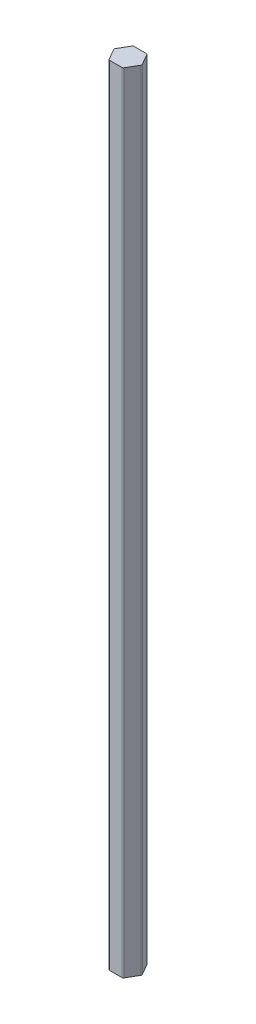
ISO-10303-21;
HEADER;
FILE_DESCRIPTION(('STEP AP214'),'2;1');
FILE_NAME('part.step','',(''),(''),'','','');
FILE_SCHEMA(('AUTOMOTIVE_DESIGN { 1 0 10303 214 1 1 1 1 }'));
ENDSEC;
DATA;
#1=APPLICATION_CONTEXT('core data for automotive mechanical design processes');
#2=APPLICATION_PROTOCOL_DEFINITION('international standard','automotive_design',2000,#1);
#3=PRODUCT_CONTEXT('',#1,'mechanical');
#4=PRODUCT('Part','Part','',(#3));
#5=PRODUCT_RELATED_PRODUCT_CATEGORY('part','',(#4));
#6=PRODUCT_DEFINITION_FORMATION('','',#4);
#7=PRODUCT_DEFINITION_CONTEXT('part definition',#1,'design');
#8=PRODUCT_DEFINITION('design','',#6,#7);
#9=PRODUCT_DEFINITION_SHAPE('','',#8);
#10=(LENGTH_UNIT() NAMED_UNIT(*) SI_UNIT(.MILLI.,.METRE.));
#11=(NAMED_UNIT(*) PLANE_ANGLE_UNIT() SI_UNIT($,.RADIAN.));
#12=(NAMED_UNIT(*) SI_UNIT($,.STERADIAN.) SOLID_ANGLE_UNIT());
#13=UNCERTAINTY_MEASURE_WITH_UNIT(LENGTH_MEASURE(1.E-05),#10,'distance_accuracy_value','');
#14=(GEOMETRIC_REPRESENTATION_CONTEXT(3) GLOBAL_UNCERTAINTY_ASSIGNED_CONTEXT((#13)) GLOBAL_UNIT_ASSIGNED_CONTEXT((#10,
#11,#12)) REPRESENTATION_CONTEXT('',''));
#15=CARTESIAN_POINT('',(0.,0.,0.));
#16=DIRECTION('',(0.,0.,1.));
#17=DIRECTION('',(1.,0.,0.));
#18=AXIS2_PLACEMENT_3D('',#15,#16,#17);
#19=CARTESIAN_POINT('',(-38.1051177665153,2860.,22.));
#20=DIRECTION('',(0.866025403784438,0.,-0.500000000000001));
#21=DIRECTION('',(-0.500000000000001,0.,-0.866025403784438));
#22=AXIS2_PLACEMENT_3D('',#19,#20,#21);
#23=PLANE('',#22);
#24=DIRECTION('',(0.5,0.,0.866025403784438));
#25=VECTOR('',#24,1.);
#26=CARTESIAN_POINT('',(-38.1051177665153,0.,22.));
#27=LINE('',#26,#25);
#28=CARTESIAN_POINT('',(-49.363448015713,0.,2.50000000000004));
#29=VERTEX_POINT('',#28);
#30=CARTESIAN_POINT('',(-26.8467875173176,0.,41.5));
#31=VERTEX_POINT('',#30);
#32=EDGE_CURVE('E160',#29,#31,#27,.T.);
#33=ORIENTED_EDGE('',*,*,#32,.T.);
#34=DIRECTION('',(0.,-1.,0.));
#35=VECTOR('',#34,1.);
#36=CARTESIAN_POINT('',(-26.8467875173176,2860.,41.5));
#37=LINE('',#36,#35);
#38=CARTESIAN_POINT('',(-26.8467875173176,2860.,41.5));
#39=VERTEX_POINT('',#38);
#40=EDGE_CURVE('E11',#39,#31,#37,.T.);
#41=ORIENTED_EDGE('',*,*,#40,.F.);
#42=DIRECTION('',(0.5,0.,0.866025403784438));
#43=VECTOR('',#42,1.);
#44=CARTESIAN_POINT('',(-38.1051177665153,2860.,22.));
#45=LINE('',#44,#43);
#46=CARTESIAN_POINT('',(-49.363448015713,2860.,2.50000000000004));
#47=VERTEX_POINT('',#46);
#48=EDGE_CURVE('E184',#47,#39,#45,.T.);
#49=ORIENTED_EDGE('',*,*,#48,.F.);
#50=DIRECTION('',(0.,-1.,0.));
#51=VECTOR('',#50,1.);
#52=CARTESIAN_POINT('',(-49.363448015713,2860.,2.50000000000004));
#53=LINE('',#52,#51);
#54=EDGE_CURVE('E156',#47,#29,#53,.T.);
#55=ORIENTED_EDGE('',*,*,#54,.T.);
#56=EDGE_LOOP('',(#33,#41,#49,#55));
#57=FACE_BOUND('',#56,.T.);
#58=ADVANCED_FACE('F39',(#57),#23,.F.);
#59=CARTESIAN_POINT('',(-22.5166604983954,2860.,39.));
#60=DIRECTION('',(0.,-1.,0.));
#61=DIRECTION('',(0.,0.,-1.));
#62=AXIS2_PLACEMENT_3D('',#59,#60,#61);
#63=CYLINDRICAL_SURFACE('',#62,5.);
#64=CARTESIAN_POINT('',(-22.5166604983954,0.,39.));
#65=DIRECTION('',(0.,1.,0.));
#66=DIRECTION('',(0.,0.,1.));
#67=AXIS2_PLACEMENT_3D('',#64,#65,#66);
#68=CIRCLE('',#67,5.);
#69=CARTESIAN_POINT('',(-22.5166604983953,0.,44.));
#70=VERTEX_POINT('',#69);
#71=EDGE_CURVE('E163',#31,#70,#68,.T.);
#72=ORIENTED_EDGE('',*,*,#71,.T.);
#73=DIRECTION('',(0.,-1.,0.));
#74=VECTOR('',#73,1.);
#75=CARTESIAN_POINT('',(-22.5166604983953,2860.,44.));
#76=LINE('',#75,#74);
#77=CARTESIAN_POINT('',(-22.5166604983953,2860.,44.));
#78=VERTEX_POINT('',#77);
#79=EDGE_CURVE('E47',#78,#70,#76,.T.);
#80=ORIENTED_EDGE('',*,*,#79,.F.);
#81=CARTESIAN_POINT('',(-22.5166604983954,2860.,39.));
#82=DIRECTION('',(0.,1.,0.));
#83=DIRECTION('',(0.,0.,1.));
#84=AXIS2_PLACEMENT_3D('',#81,#82,#83);
#85=CIRCLE('',#84,5.);
#86=EDGE_CURVE('E110',#39,#78,#85,.T.);
#87=ORIENTED_EDGE('',*,*,#86,.F.);
#88=ORIENTED_EDGE('',*,*,#40,.T.);
#89=EDGE_LOOP('',(#72,#80,#87,#88));
#90=FACE_BOUND('',#89,.T.);
#91=ADVANCED_FACE('F258',(#90),#63,.T.);
#92=CARTESIAN_POINT('',(0.,2860.,44.));
#93=DIRECTION('',(0.,0.,-1.));
#94=DIRECTION('',(-1.,0.,0.));
#95=AXIS2_PLACEMENT_3D('',#92,#93,#94);
#96=PLANE('',#95);
#97=DIRECTION('',(1.,0.,0.));
#98=VECTOR('',#97,1.);
#99=CARTESIAN_POINT('',(0.,0.,44.));
#100=LINE('',#99,#98);
#101=CARTESIAN_POINT('',(22.5166604983954,0.,44.));
#102=VERTEX_POINT('',#101);
#103=EDGE_CURVE('E165',#70,#102,#100,.T.);
#104=ORIENTED_EDGE('',*,*,#103,.T.);
#105=DIRECTION('',(0.,-1.,0.));
#106=VECTOR('',#105,1.);
#107=CARTESIAN_POINT('',(22.5166604983954,2860.,44.));
#108=LINE('',#107,#106);
#109=CARTESIAN_POINT('',(22.5166604983954,2860.,44.));
#110=VERTEX_POINT('',#109);
#111=EDGE_CURVE('E201',#110,#102,#108,.T.);
#112=ORIENTED_EDGE('',*,*,#111,.F.);
#113=DIRECTION('',(1.,0.,0.));
#114=VECTOR('',#113,1.);
#115=CARTESIAN_POINT('',(0.,2860.,44.));
#116=LINE('',#115,#114);
#117=EDGE_CURVE('E209',#78,#110,#116,.T.);
#118=ORIENTED_EDGE('',*,*,#117,.F.);
#119=ORIENTED_EDGE('',*,*,#79,.T.);
#120=EDGE_LOOP('',(#104,#112,#118,#119));
#121=FACE_BOUND('',#120,.T.);
#122=ADVANCED_FACE('F207',(#121),#96,.F.);
#123=CARTESIAN_POINT('',(22.5166604983954,2860.,39.));
#124=DIRECTION('',(0.,-1.,0.));
#125=DIRECTION('',(0.,0.,-1.));
#126=AXIS2_PLACEMENT_3D('',#123,#124,#125);
#127=CYLINDRICAL_SURFACE('',#126,5.);
#128=CARTESIAN_POINT('',(22.5166604983954,0.,39.));
#129=DIRECTION('',(0.,1.,0.));
#130=DIRECTION('',(0.,0.,1.));
#131=AXIS2_PLACEMENT_3D('',#128,#129,#130);
#132=CIRCLE('',#131,5.);
#133=CARTESIAN_POINT('',(26.8467875173176,0.,41.5));
#134=VERTEX_POINT('',#133);
#135=EDGE_CURVE('E167',#102,#134,#132,.T.);
#136=ORIENTED_EDGE('',*,*,#135,.T.);
#137=DIRECTION('',(0.,-1.,0.));
#138=VECTOR('',#137,1.);
#139=CARTESIAN_POINT('',(26.8467875173176,2860.,41.5));
#140=LINE('',#139,#138);
#141=CARTESIAN_POINT('',(26.8467875173176,2860.,41.5));
#142=VERTEX_POINT('',#141);
#143=EDGE_CURVE('E198',#142,#134,#140,.T.);
#144=ORIENTED_EDGE('',*,*,#143,.F.);
#145=CARTESIAN_POINT('',(22.5166604983954,2860.,39.));
#146=DIRECTION('',(0.,1.,0.));
#147=DIRECTION('',(0.,0.,1.));
#148=AXIS2_PLACEMENT_3D('',#145,#146,#147);
#149=CIRCLE('',#148,5.);
#150=EDGE_CURVE('E227',#110,#142,#149,.T.);
#151=ORIENTED_EDGE('',*,*,#150,.F.);
#152=ORIENTED_EDGE('',*,*,#111,.T.);
#153=EDGE_LOOP('',(#136,#144,#151,#152));
#154=FACE_BOUND('',#153,.T.);
#155=ADVANCED_FACE('F218',(#154),#127,.T.);
#156=CARTESIAN_POINT('',(38.1051177665153,2860.,22.));
#157=DIRECTION('',(-0.866025403784439,0.,-0.5));
#158=DIRECTION('',(-0.5,0.,0.866025403784439));
#159=AXIS2_PLACEMENT_3D('',#156,#157,#158);
#160=PLANE('',#159);
#161=DIRECTION('',(0.5,0.,-0.866025403784439));
#162=VECTOR('',#161,1.);
#163=CARTESIAN_POINT('',(38.1051177665153,0.,22.));
#164=LINE('',#163,#162);
#165=CARTESIAN_POINT('',(49.363448015713,0.,2.5));
#166=VERTEX_POINT('',#165);
#167=EDGE_CURVE('E169',#134,#166,#164,.T.);
#168=ORIENTED_EDGE('',*,*,#167,.T.);
#169=DIRECTION('',(0.,-1.,0.));
#170=VECTOR('',#169,1.);
#171=CARTESIAN_POINT('',(49.363448015713,2860.,2.5));
#172=LINE('',#171,#170);
#173=CARTESIAN_POINT('',(49.363448015713,2860.,2.5));
#174=VERTEX_POINT('',#173);
#175=EDGE_CURVE('E195',#174,#166,#172,.T.);
#176=ORIENTED_EDGE('',*,*,#175,.F.);
#177=DIRECTION('',(0.5,0.,-0.866025403784439));
#178=VECTOR('',#177,1.);
#179=CARTESIAN_POINT('',(38.1051177665153,2860.,22.));
#180=LINE('',#179,#178);
#181=EDGE_CURVE('E224',#142,#174,#180,.T.);
#182=ORIENTED_EDGE('',*,*,#181,.F.);
#183=ORIENTED_EDGE('',*,*,#143,.T.);
#184=EDGE_LOOP('',(#168,#176,#182,#183));
#185=FACE_BOUND('',#184,.T.);
#186=ADVANCED_FACE('F222',(#185),#160,.F.);
#187=CARTESIAN_POINT('',(45.0333209967908,2860.,0.));
#188=DIRECTION('',(0.,-1.,0.));
#189=DIRECTION('',(0.,0.,-1.));
#190=AXIS2_PLACEMENT_3D('',#187,#188,#189);
#191=CYLINDRICAL_SURFACE('',#190,5.);
#192=CARTESIAN_POINT('',(45.0333209967908,0.,0.));
#193=DIRECTION('',(0.,1.,0.));
#194=DIRECTION('',(0.,0.,1.));
#195=AXIS2_PLACEMENT_3D('',#192,#193,#194);
#196=CIRCLE('',#195,5.);
#197=CARTESIAN_POINT('',(49.363448015713,0.,-2.50000000000005));
#198=VERTEX_POINT('',#197);
#199=EDGE_CURVE('E171',#166,#198,#196,.T.);
#200=ORIENTED_EDGE('',*,*,#199,.T.);
#201=DIRECTION('',(0.,-1.,0.));
#202=VECTOR('',#201,1.);
#203=CARTESIAN_POINT('',(49.363448015713,2860.,-2.50000000000005));
#204=LINE('',#203,#202);
#205=CARTESIAN_POINT('',(49.363448015713,2860.,-2.50000000000005));
#206=VERTEX_POINT('',#205);
#207=EDGE_CURVE('E192',#206,#198,#204,.T.);
#208=ORIENTED_EDGE('',*,*,#207,.F.);
#209=CARTESIAN_POINT('',(45.0333209967908,2860.,0.));
#210=DIRECTION('',(0.,1.,0.));
#211=DIRECTION('',(0.,0.,1.));
#212=AXIS2_PLACEMENT_3D('',#209,#210,#211);
#213=CIRCLE('',#212,5.);
#214=EDGE_CURVE('E226',#174,#206,#213,.T.);
#215=ORIENTED_EDGE('',*,*,#214,.F.);
#216=ORIENTED_EDGE('',*,*,#175,.T.);
#217=EDGE_LOOP('',(#200,#208,#215,#216));
#218=FACE_BOUND('',#217,.T.);
#219=ADVANCED_FACE('F317',(#218),#191,.T.);
#220=CARTESIAN_POINT('',(38.1051177665153,2860.,-22.));
#221=DIRECTION('',(-0.866025403784438,0.,0.500000000000001));
#222=DIRECTION('',(0.500000000000001,0.,0.866025403784438));
#223=AXIS2_PLACEMENT_3D('',#220,#221,#222);
#224=PLANE('',#223);
#225=DIRECTION('',(-0.5,0.,-0.866025403784438));
#226=VECTOR('',#225,1.);
#227=CARTESIAN_POINT('',(38.1051177665153,0.,-22.));
#228=LINE('',#227,#226);
#229=CARTESIAN_POINT('',(26.8467875173176,0.,-41.5));
#230=VERTEX_POINT('',#229);
#231=EDGE_CURVE('E173',#198,#230,#228,.T.);
#232=ORIENTED_EDGE('',*,*,#231,.T.);
#233=DIRECTION('',(0.,-1.,0.));
#234=VECTOR('',#233,1.);
#235=CARTESIAN_POINT('',(26.8467875173176,2860.,-41.5));
#236=LINE('',#235,#234);
#237=CARTESIAN_POINT('',(26.8467875173176,2860.,-41.5));
#238=VERTEX_POINT('',#237);
#239=EDGE_CURVE('E190',#238,#230,#236,.T.);
#240=ORIENTED_EDGE('',*,*,#239,.F.);
#241=DIRECTION('',(-0.5,0.,-0.866025403784438));
#242=VECTOR('',#241,1.);
#243=CARTESIAN_POINT('',(38.1051177665153,2860.,-22.));
#244=LINE('',#243,#242);
#245=EDGE_CURVE('E229',#206,#238,#244,.T.);
#246=ORIENTED_EDGE('',*,*,#245,.F.);
#247=ORIENTED_EDGE('',*,*,#207,.T.);
#248=EDGE_LOOP('',(#232,#240,#246,#247));
#249=FACE_BOUND('',#248,.T.);
#250=ADVANCED_FACE('F244',(#249),#224,.F.);
#251=CARTESIAN_POINT('',(22.5166604983954,2860.,-39.));
#252=DIRECTION('',(0.,-1.,0.));
#253=DIRECTION('',(0.,0.,-1.));
#254=AXIS2_PLACEMENT_3D('',#251,#252,#253);
#255=CYLINDRICAL_SURFACE('',#254,5.);
#256=CARTESIAN_POINT('',(22.5166604983954,0.,-39.));
#257=DIRECTION('',(0.,1.,0.));
#258=DIRECTION('',(0.,0.,1.));
#259=AXIS2_PLACEMENT_3D('',#256,#257,#258);
#260=CIRCLE('',#259,5.);
#261=CARTESIAN_POINT('',(22.5166604983954,0.,-44.));
#262=VERTEX_POINT('',#261);
#263=EDGE_CURVE('E176',#262,#230,#260,.F.);
#264=ORIENTED_EDGE('',*,*,#263,.F.);
#265=DIRECTION('',(0.,-1.,0.));
#266=VECTOR('',#265,1.);
#267=CARTESIAN_POINT('',(22.5166604983954,2860.,-44.));
#268=LINE('',#267,#266);
#269=CARTESIAN_POINT('',(22.5166604983954,2860.,-44.));
#270=VERTEX_POINT('',#269);
#271=EDGE_CURVE('E188',#270,#262,#268,.T.);
#272=ORIENTED_EDGE('',*,*,#271,.F.);
#273=CARTESIAN_POINT('',(22.5166604983954,2860.,-39.));
#274=DIRECTION('',(0.,1.,0.));
#275=DIRECTION('',(0.,0.,1.));
#276=AXIS2_PLACEMENT_3D('',#273,#274,#275);
#277=CIRCLE('',#276,5.);
#278=EDGE_CURVE('E235',#270,#238,#277,.F.);
#279=ORIENTED_EDGE('',*,*,#278,.T.);
#280=ORIENTED_EDGE('',*,*,#239,.T.);
#281=EDGE_LOOP('',(#264,#272,#279,#280));
#282=FACE_BOUND('',#281,.T.);
#283=ADVANCED_FACE('F239',(#282),#255,.T.);
#284=CARTESIAN_POINT('',(0.,2860.,-44.));
#285=DIRECTION('',(0.,0.,1.));
#286=DIRECTION('',(1.,0.,0.));
#287=AXIS2_PLACEMENT_3D('',#284,#285,#286);
#288=PLANE('',#287);
#289=DIRECTION('',(-1.,0.,0.));
#290=VECTOR('',#289,1.);
#291=CARTESIAN_POINT('',(0.,0.,-44.));
#292=LINE('',#291,#290);
#293=CARTESIAN_POINT('',(-22.5166604983954,0.,-44.));
#294=VERTEX_POINT('',#293);
#295=EDGE_CURVE('E179',#262,#294,#292,.T.);
#296=ORIENTED_EDGE('',*,*,#295,.T.);
#297=DIRECTION('',(0.,-1.,0.));
#298=VECTOR('',#297,1.);
#299=CARTESIAN_POINT('',(-22.5166604983954,2860.,-44.));
#300=LINE('',#299,#298);
#301=CARTESIAN_POINT('',(-22.5166604983954,2860.,-44.));
#302=VERTEX_POINT('',#301);
#303=EDGE_CURVE('E151',#302,#294,#300,.T.);
#304=ORIENTED_EDGE('',*,*,#303,.F.);
#305=DIRECTION('',(-1.,0.,0.));
#306=VECTOR('',#305,1.);
#307=CARTESIAN_POINT('',(0.,2860.,-44.));
#308=LINE('',#307,#306);
#309=EDGE_CURVE('E142',#270,#302,#308,.T.);
#310=ORIENTED_EDGE('',*,*,#309,.F.);
#311=ORIENTED_EDGE('',*,*,#271,.T.);
#312=EDGE_LOOP('',(#296,#304,#310,#311));
#313=FACE_BOUND('',#312,.T.);
#314=ADVANCED_FACE('F248',(#313),#288,.F.);
#315=CARTESIAN_POINT('',(-22.5166604983954,2860.,-39.));
#316=DIRECTION('',(0.,-1.,0.));
#317=DIRECTION('',(0.,0.,-1.));
#318=AXIS2_PLACEMENT_3D('',#315,#316,#317);
#319=CYLINDRICAL_SURFACE('',#318,5.);
#320=CARTESIAN_POINT('',(-22.5166604983954,0.,-39.));
#321=DIRECTION('',(0.,1.,0.));
#322=DIRECTION('',(0.,0.,1.));
#323=AXIS2_PLACEMENT_3D('',#320,#321,#322);
#324=CIRCLE('',#323,5.);
#325=CARTESIAN_POINT('',(-26.8467875173176,0.,-41.5));
#326=VERTEX_POINT('',#325);
#327=EDGE_CURVE('E150',#294,#326,#324,.T.);
#328=ORIENTED_EDGE('',*,*,#327,.T.);
#329=DIRECTION('',(0.,-1.,0.));
#330=VECTOR('',#329,1.);
#331=CARTESIAN_POINT('',(-26.8467875173176,2860.,-41.5));
#332=LINE('',#331,#330);
#333=CARTESIAN_POINT('',(-26.8467875173176,2860.,-41.5));
#334=VERTEX_POINT('',#333);
#335=EDGE_CURVE('E147',#334,#326,#332,.T.);
#336=ORIENTED_EDGE('',*,*,#335,.F.);
#337=CARTESIAN_POINT('',(-22.5166604983954,2860.,-39.));
#338=DIRECTION('',(0.,1.,0.));
#339=DIRECTION('',(0.,0.,1.));
#340=AXIS2_PLACEMENT_3D('',#337,#338,#339);
#341=CIRCLE('',#340,5.);
#342=EDGE_CURVE('E135',#302,#334,#341,.T.);
#343=ORIENTED_EDGE('',*,*,#342,.F.);
#344=ORIENTED_EDGE('',*,*,#303,.T.);
#345=EDGE_LOOP('',(#328,#336,#343,#344));
#346=FACE_BOUND('',#345,.T.);
#347=ADVANCED_FACE('F148',(#346),#319,.T.);
#348=CARTESIAN_POINT('',(-38.1051177665153,2860.,-22.));
#349=DIRECTION('',(0.866025403784439,0.,0.5));
#350=DIRECTION('',(0.5,0.,-0.866025403784439));
#351=AXIS2_PLACEMENT_3D('',#348,#349,#350);
#352=PLANE('',#351);
#353=DIRECTION('',(-0.5,0.,0.866025403784439));
#354=VECTOR('',#353,1.);
#355=CARTESIAN_POINT('',(-38.1051177665153,0.,-22.));
#356=LINE('',#355,#354);
#357=CARTESIAN_POINT('',(-49.363448015713,0.,-2.50000000000001));
#358=VERTEX_POINT('',#357);
#359=EDGE_CURVE('E96',#326,#358,#356,.T.);
#360=ORIENTED_EDGE('',*,*,#359,.T.);
#361=DIRECTION('',(0.,-1.,0.));
#362=VECTOR('',#361,1.);
#363=CARTESIAN_POINT('',(-49.363448015713,2860.,-2.50000000000001));
#364=LINE('',#363,#362);
#365=CARTESIAN_POINT('',(-49.363448015713,2860.,-2.50000000000001));
#366=VERTEX_POINT('',#365);
#367=EDGE_CURVE('E152',#366,#358,#364,.T.);
#368=ORIENTED_EDGE('',*,*,#367,.F.);
#369=DIRECTION('',(-0.5,0.,0.866025403784439));
#370=VECTOR('',#369,1.);
#371=CARTESIAN_POINT('',(-38.1051177665153,2860.,-22.));
#372=LINE('',#371,#370);
#373=EDGE_CURVE('E139',#334,#366,#372,.T.);
#374=ORIENTED_EDGE('',*,*,#373,.F.);
#375=ORIENTED_EDGE('',*,*,#335,.T.);
#376=EDGE_LOOP('',(#360,#368,#374,#375));
#377=FACE_BOUND('',#376,.T.);
#378=ADVANCED_FACE('F154',(#377),#352,.F.);
#379=CARTESIAN_POINT('',(-45.0333209967908,2860.,0.));
#380=DIRECTION('',(0.,-1.,0.));
#381=DIRECTION('',(0.,0.,-1.));
#382=AXIS2_PLACEMENT_3D('',#379,#380,#381);
#383=CYLINDRICAL_SURFACE('',#382,5.);
#384=CARTESIAN_POINT('',(-45.0333209967908,0.,0.));
#385=DIRECTION('',(0.,1.,0.));
#386=DIRECTION('',(0.,0.,1.));
#387=AXIS2_PLACEMENT_3D('',#384,#385,#386);
#388=CIRCLE('',#387,5.);
#389=EDGE_CURVE('E102',#358,#29,#388,.T.);
#390=ORIENTED_EDGE('',*,*,#389,.T.);
#391=ORIENTED_EDGE('',*,*,#54,.F.);
#392=CARTESIAN_POINT('',(-45.0333209967908,2860.,0.));
#393=DIRECTION('',(0.,1.,0.));
#394=DIRECTION('',(0.,0.,1.));
#395=AXIS2_PLACEMENT_3D('',#392,#393,#394);
#396=CIRCLE('',#395,5.);
#397=EDGE_CURVE('E55',#366,#47,#396,.T.);
#398=ORIENTED_EDGE('',*,*,#397,.F.);
#399=ORIENTED_EDGE('',*,*,#367,.T.);
#400=EDGE_LOOP('',(#390,#391,#398,#399));
#401=FACE_BOUND('',#400,.T.);
#402=ADVANCED_FACE('F265',(#401),#383,.T.);
#403=CARTESIAN_POINT('',(0.,2860.,0.));
#404=DIRECTION('',(0.,1.,0.));
#405=DIRECTION('',(0.,0.,1.));
#406=AXIS2_PLACEMENT_3D('',#403,#404,#405);
#407=PLANE('',#406);
#408=ORIENTED_EDGE('',*,*,#48,.T.);
#409=ORIENTED_EDGE('',*,*,#86,.T.);
#410=ORIENTED_EDGE('',*,*,#117,.T.);
#411=ORIENTED_EDGE('',*,*,#150,.T.);
#412=ORIENTED_EDGE('',*,*,#181,.T.);
#413=ORIENTED_EDGE('',*,*,#214,.T.);
#414=ORIENTED_EDGE('',*,*,#245,.T.);
#415=ORIENTED_EDGE('',*,*,#278,.F.);
#416=ORIENTED_EDGE('',*,*,#309,.T.);
#417=ORIENTED_EDGE('',*,*,#342,.T.);
#418=ORIENTED_EDGE('',*,*,#373,.T.);
#419=ORIENTED_EDGE('',*,*,#397,.T.);
#420=EDGE_LOOP('',(#408,#409,#410,#411,#412,#413,#414,#415,#416,#417,#418,#419));
#421=FACE_BOUND('',#420,.T.);
#422=ADVANCED_FACE('F137',(#421),#407,.T.);
#423=CARTESIAN_POINT('',(0.,0.,0.));
#424=DIRECTION('',(0.,1.,0.));
#425=DIRECTION('',(0.,0.,1.));
#426=AXIS2_PLACEMENT_3D('',#423,#424,#425);
#427=PLANE('',#426);
#428=ORIENTED_EDGE('',*,*,#32,.F.);
#429=ORIENTED_EDGE('',*,*,#389,.F.);
#430=ORIENTED_EDGE('',*,*,#359,.F.);
#431=ORIENTED_EDGE('',*,*,#327,.F.);
#432=ORIENTED_EDGE('',*,*,#295,.F.);
#433=ORIENTED_EDGE('',*,*,#263,.T.);
#434=ORIENTED_EDGE('',*,*,#231,.F.);
#435=ORIENTED_EDGE('',*,*,#199,.F.);
#436=ORIENTED_EDGE('',*,*,#167,.F.);
#437=ORIENTED_EDGE('',*,*,#135,.F.);
#438=ORIENTED_EDGE('',*,*,#103,.F.);
#439=ORIENTED_EDGE('',*,*,#71,.F.);
#440=EDGE_LOOP('',(#428,#429,#430,#431,#432,#433,#434,#435,#436,#437,#438,#439));
#441=FACE_BOUND('',#440,.T.);
#442=ADVANCED_FACE('F213',(#441),#427,.F.);
#443=CLOSED_SHELL('',(#58,#91,#122,#155,#186,#219,#250,#283,#314,#347,#378,#402,#422,#442));
#444=MANIFOLD_SOLID_BREP('B2',#443);
#445=ADVANCED_BREP_SHAPE_REPRESENTATION('',(#18,#444),#14);
#446=SHAPE_DEFINITION_REPRESENTATION(#9,#445);
ENDSEC;
END-ISO-10303-21;
